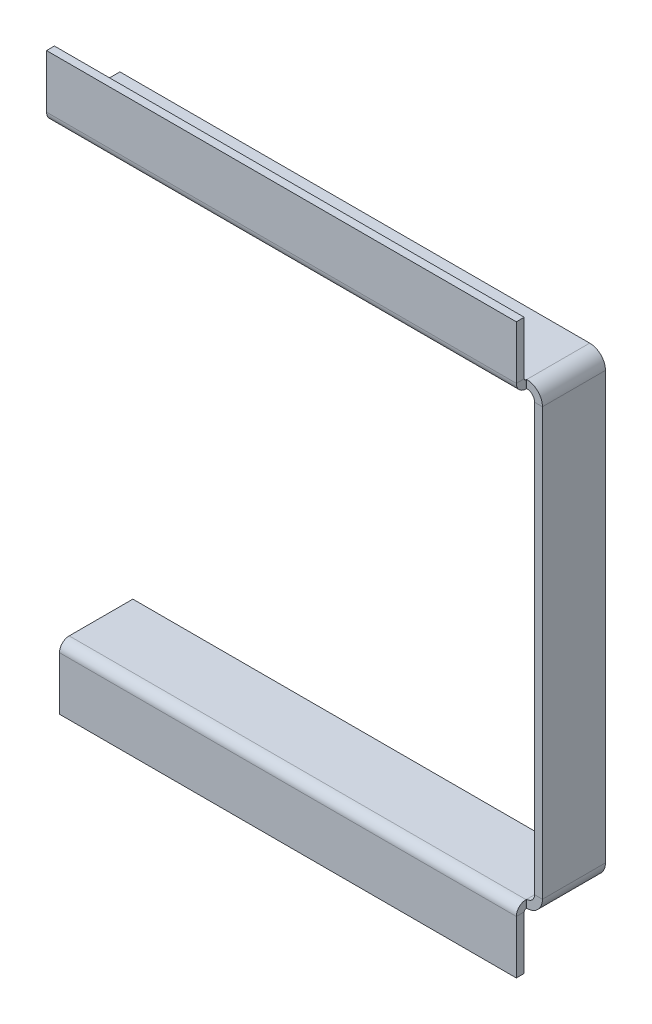
ISO-10303-21;
HEADER;
FILE_DESCRIPTION(('STEP AP214'),'2;1');
FILE_NAME('part.step','',(''),(''),'','','');
FILE_SCHEMA(('AUTOMOTIVE_DESIGN { 1 0 10303 214 1 1 1 1 }'));
ENDSEC;
DATA;
#1=APPLICATION_CONTEXT('core data for automotive mechanical design processes');
#2=APPLICATION_PROTOCOL_DEFINITION('international standard','automotive_design',2000,#1);
#3=PRODUCT_CONTEXT('',#1,'mechanical');
#4=PRODUCT('Part','Part','',(#3));
#5=PRODUCT_RELATED_PRODUCT_CATEGORY('part','',(#4));
#6=PRODUCT_DEFINITION_FORMATION('','',#4);
#7=PRODUCT_DEFINITION_CONTEXT('part definition',#1,'design');
#8=PRODUCT_DEFINITION('design','',#6,#7);
#9=PRODUCT_DEFINITION_SHAPE('','',#8);
#10=(LENGTH_UNIT() NAMED_UNIT(*) SI_UNIT(.MILLI.,.METRE.));
#11=(NAMED_UNIT(*) PLANE_ANGLE_UNIT() SI_UNIT($,.RADIAN.));
#12=(NAMED_UNIT(*) SI_UNIT($,.STERADIAN.) SOLID_ANGLE_UNIT());
#13=UNCERTAINTY_MEASURE_WITH_UNIT(LENGTH_MEASURE(1.E-05),#10,'distance_accuracy_value','');
#14=(GEOMETRIC_REPRESENTATION_CONTEXT(3) GLOBAL_UNCERTAINTY_ASSIGNED_CONTEXT((#13)) GLOBAL_UNIT_ASSIGNED_CONTEXT((#10,
#11,#12)) REPRESENTATION_CONTEXT('',''));
#15=CARTESIAN_POINT('',(0.,0.,0.));
#16=DIRECTION('',(0.,0.,1.));
#17=DIRECTION('',(1.,0.,0.));
#18=AXIS2_PLACEMENT_3D('',#15,#16,#17);
#19=CARTESIAN_POINT('',(-1.4287735626259E-12,179.254094750536,-182.429094750536));
#20=DIRECTION('',(0.,1.,0.));
#21=DIRECTION('',(0.,0.,1.));
#22=AXIS2_PLACEMENT_3D('',#19,#20,#21);
#23=PLANE('',#22);
#24=DIRECTION('',(0.,0.,1.));
#25=VECTOR('',#24,1.);
#26=CARTESIAN_POINT('',(-96.0437500000013,179.254094750536,-169.729094750535));
#27=LINE('',#26,#25);
#28=CARTESIAN_POINT('',(-96.0437500000013,179.254094750536,-169.729094750535));
#29=VERTEX_POINT('',#28);
#30=CARTESIAN_POINT('',(-96.0437500000013,179.254094750536,-169.468182493639));
#31=VERTEX_POINT('',#30);
#32=EDGE_CURVE('E52',#29,#31,#27,.T.);
#33=ORIENTED_EDGE('',*,*,#32,.T.);
#34=DIRECTION('',(-1.,0.,0.));
#35=VECTOR('',#34,1.);
#36=CARTESIAN_POINT('',(-1.33874293748464E-12,179.254094750536,-169.46818249364));
#37=LINE('',#36,#35);
#38=CARTESIAN_POINT('',(-280.183590000001,179.254094750535,-169.468182493638));
#39=VERTEX_POINT('',#38);
#40=EDGE_CURVE('E198',#31,#39,#37,.T.);
#41=ORIENTED_EDGE('',*,*,#40,.T.);
#42=DIRECTION('',(0.,0.,1.));
#43=VECTOR('',#42,1.);
#44=CARTESIAN_POINT('',(-280.183590000001,179.254094750535,-169.729094750533));
#45=LINE('',#44,#43);
#46=CARTESIAN_POINT('',(-280.183590000002,179.254094750535,-195.129094750533));
#47=VERTEX_POINT('',#46);
#48=EDGE_CURVE('E234',#47,#39,#45,.T.);
#49=ORIENTED_EDGE('',*,*,#48,.F.);
#50=DIRECTION('',(-1.,0.,0.));
#51=VECTOR('',#50,1.);
#52=CARTESIAN_POINT('',(-280.183590000002,179.254094750535,-195.129094750533));
#53=LINE('',#52,#51);
#54=CARTESIAN_POINT('',(-96.0437500000016,179.254094750536,-195.129094750535));
#55=VERTEX_POINT('',#54);
#56=EDGE_CURVE('E333',#55,#47,#53,.T.);
#57=ORIENTED_EDGE('',*,*,#56,.F.);
#58=DIRECTION('',(0.,0.,-1.));
#59=VECTOR('',#58,1.);
#60=CARTESIAN_POINT('',(-96.0437500000014,179.254094750536,-182.429094750535));
#61=LINE('',#60,#59);
#62=EDGE_CURVE('E221',#29,#55,#61,.T.);
#63=ORIENTED_EDGE('',*,*,#62,.F.);
#64=EDGE_LOOP('',(#33,#41,#49,#57,#63));
#65=FACE_BOUND('',#64,.T.);
#66=ADVANCED_FACE('F48',(#65),#23,.F.);
#67=CARTESIAN_POINT('',(-285.402672493642,363.860677244173,-169.729094750533));
#68=DIRECTION('',(-1.,0.,0.));
#69=DIRECTION('',(0.,0.,-1.));
#70=AXIS2_PLACEMENT_3D('',#67,#68,#69);
#71=PLANE('',#70);
#72=DIRECTION('',(0.,0.,-1.));
#73=VECTOR('',#72,1.);
#74=CARTESIAN_POINT('',(-285.402672493642,360.685677244173,-169.729094750533));
#75=LINE('',#74,#73);
#76=CARTESIAN_POINT('',(-285.402672493642,360.685677244173,-169.468182493637));
#77=VERTEX_POINT('',#76);
#78=CARTESIAN_POINT('',(-285.402672493642,360.685677244173,-195.129094750533));
#79=VERTEX_POINT('',#78);
#80=EDGE_CURVE('E289',#77,#79,#75,.T.);
#81=ORIENTED_EDGE('',*,*,#80,.F.);
#82=DIRECTION('',(0.,1.,0.));
#83=VECTOR('',#82,1.);
#84=CARTESIAN_POINT('',(-285.402672493642,363.860677244173,-169.468182493637));
#85=LINE('',#84,#83);
#86=CARTESIAN_POINT('',(-285.402672493642,363.860677244173,-169.468182493637));
#87=VERTEX_POINT('',#86);
#88=EDGE_CURVE('E378',#77,#87,#85,.T.);
#89=ORIENTED_EDGE('',*,*,#88,.T.);
#90=DIRECTION('',(0.,0.,-1.));
#91=VECTOR('',#90,1.);
#92=CARTESIAN_POINT('',(-285.402672493642,363.860677244173,-169.729094750533));
#93=LINE('',#92,#91);
#94=CARTESIAN_POINT('',(-285.402672493642,363.860677244173,-195.129094750533));
#95=VERTEX_POINT('',#94);
#96=EDGE_CURVE('E298',#87,#95,#93,.T.);
#97=ORIENTED_EDGE('',*,*,#96,.T.);
#98=DIRECTION('',(0.,-1.,0.));
#99=VECTOR('',#98,1.);
#100=CARTESIAN_POINT('',(-285.402672493642,363.860677244173,-195.129094750533));
#101=LINE('',#100,#99);
#102=EDGE_CURVE('E295',#95,#79,#101,.T.);
#103=ORIENTED_EDGE('',*,*,#102,.T.);
#104=EDGE_LOOP('',(#81,#89,#97,#103));
#105=FACE_BOUND('',#104,.T.);
#106=ADVANCED_FACE('F515',(#105),#71,.T.);
#107=CARTESIAN_POINT('',(-5.21908249364198,360.685677244176,-182.429094750536));
#108=DIRECTION('',(0.,-1.,0.));
#109=DIRECTION('',(0.,0.,1.));
#110=AXIS2_PLACEMENT_3D('',#107,#108,#109);
#111=PLANE('',#110);
#112=DIRECTION('',(0.,0.,-1.));
#113=VECTOR('',#112,1.);
#114=CARTESIAN_POINT('',(-96.0437500000026,360.685677244175,-169.729094750535));
#115=LINE('',#114,#113);
#116=CARTESIAN_POINT('',(-96.0437500000025,360.685677244175,-169.468182493639));
#117=VERTEX_POINT('',#116);
#118=CARTESIAN_POINT('',(-96.0437500000025,360.685677244175,-169.729094750535));
#119=VERTEX_POINT('',#118);
#120=EDGE_CURVE('E72',#117,#119,#115,.T.);
#121=ORIENTED_EDGE('',*,*,#120,.F.);
#122=DIRECTION('',(-1.,0.,0.));
#123=VECTOR('',#122,1.);
#124=CARTESIAN_POINT('',(-5.21908249364184,360.685677244176,-169.46818249364));
#125=LINE('',#124,#123);
#126=EDGE_CURVE('E380',#117,#77,#125,.T.);
#127=ORIENTED_EDGE('',*,*,#126,.T.);
#128=ORIENTED_EDGE('',*,*,#80,.T.);
#129=DIRECTION('',(1.,0.,0.));
#130=VECTOR('',#129,1.);
#131=CARTESIAN_POINT('',(274.964507506358,360.685677244179,-195.129094750539));
#132=LINE('',#131,#130);
#133=CARTESIAN_POINT('',(-96.0437500000028,360.685677244175,-195.129094750535));
#134=VERTEX_POINT('',#133);
#135=EDGE_CURVE('E286',#79,#134,#132,.T.);
#136=ORIENTED_EDGE('',*,*,#135,.T.);
#137=DIRECTION('',(0.,0.,-1.));
#138=VECTOR('',#137,1.);
#139=CARTESIAN_POINT('',(-96.0437500000027,360.685677244175,-182.429094750535));
#140=LINE('',#139,#138);
#141=EDGE_CURVE('E302',#119,#134,#140,.T.);
#142=ORIENTED_EDGE('',*,*,#141,.F.);
#143=EDGE_LOOP('',(#121,#127,#128,#136,#142));
#144=FACE_BOUND('',#143,.T.);
#145=ADVANCED_FACE('F403',(#144),#111,.T.);
#146=CARTESIAN_POINT('',(-96.0437500000026,360.685677244175,-169.729094750535));
#147=DIRECTION('',(1.,0.,0.));
#148=DIRECTION('',(0.,1.,0.));
#149=AXIS2_PLACEMENT_3D('',#146,#147,#148);
#150=PLANE('',#149);
#151=DIRECTION('',(0.,0.,-1.));
#152=VECTOR('',#151,1.);
#153=CARTESIAN_POINT('',(-96.0437500000026,363.860677244175,-169.729094750535));
#154=LINE('',#153,#152);
#155=CARTESIAN_POINT('',(-96.0437500000026,363.860677244175,-169.468182493639));
#156=VERTEX_POINT('',#155);
#157=CARTESIAN_POINT('',(-96.0437500000026,363.860677244175,-169.729094750535));
#158=VERTEX_POINT('',#157);
#159=EDGE_CURVE('E256',#156,#158,#154,.T.);
#160=ORIENTED_EDGE('',*,*,#159,.F.);
#161=DIRECTION('',(0.,-1.,0.));
#162=VECTOR('',#161,1.);
#163=CARTESIAN_POINT('',(-96.0437500000025,360.685677244175,-169.468182493639));
#164=LINE('',#163,#162);
#165=EDGE_CURVE('E208',#156,#117,#164,.T.);
#166=ORIENTED_EDGE('',*,*,#165,.T.);
#167=ORIENTED_EDGE('',*,*,#120,.T.);
#168=DIRECTION('',(0.,-1.,0.));
#169=VECTOR('',#168,1.);
#170=CARTESIAN_POINT('',(-96.0437500000026,363.860677244175,-169.729094750535));
#171=LINE('',#170,#169);
#172=EDGE_CURVE('E305',#158,#119,#171,.T.);
#173=ORIENTED_EDGE('',*,*,#172,.F.);
#174=EDGE_LOOP('',(#160,#166,#167,#173));
#175=FACE_BOUND('',#174,.T.);
#176=ADVANCED_FACE('F401',(#175),#150,.T.);
#177=CARTESIAN_POINT('',(-92.8687500000021,274.166927244175,-182.429094750535));
#178=DIRECTION('',(-1.,0.,0.));
#179=DIRECTION('',(0.,0.,1.));
#180=AXIS2_PLACEMENT_3D('',#177,#178,#179);
#181=PLANE('',#180);
#182=DIRECTION('',(0.,1.,0.));
#183=VECTOR('',#182,1.);
#184=CARTESIAN_POINT('',(-92.86875,-6.0166627558248,-169.729094750535));
#185=LINE('',#184,#183);
#186=CARTESIAN_POINT('',(-92.8687500000013,185.604094750536,-169.729094750535));
#187=VERTEX_POINT('',#186);
#188=CARTESIAN_POINT('',(-92.8687500000025,357.510677244175,-169.729094750535));
#189=VERTEX_POINT('',#188);
#190=EDGE_CURVE('E371',#187,#189,#185,.T.);
#191=ORIENTED_EDGE('',*,*,#190,.T.);
#192=DIRECTION('',(0.,0.,-1.));
#193=VECTOR('',#192,1.);
#194=CARTESIAN_POINT('',(-92.8687500000026,357.510677244175,-182.429094750535));
#195=LINE('',#194,#193);
#196=CARTESIAN_POINT('',(-92.8687500000028,357.510677244175,-195.129094750535));
#197=VERTEX_POINT('',#196);
#198=EDGE_CURVE('E359',#189,#197,#195,.T.);
#199=ORIENTED_EDGE('',*,*,#198,.T.);
#200=DIRECTION('',(0.,-1.,0.));
#201=VECTOR('',#200,1.);
#202=CARTESIAN_POINT('',(-92.8687500000002,-6.0166627558248,-195.129094750535));
#203=LINE('',#202,#201);
#204=CARTESIAN_POINT('',(-92.8687500000016,185.604094750536,-195.129094750535));
#205=VERTEX_POINT('',#204);
#206=EDGE_CURVE('E332',#197,#205,#203,.T.);
#207=ORIENTED_EDGE('',*,*,#206,.T.);
#208=DIRECTION('',(0.,0.,-1.));
#209=VECTOR('',#208,1.);
#210=CARTESIAN_POINT('',(-92.8687500000014,185.604094750536,-182.429094750535));
#211=LINE('',#210,#209);
#212=EDGE_CURVE('E349',#187,#205,#211,.T.);
#213=ORIENTED_EDGE('',*,*,#212,.F.);
#214=EDGE_LOOP('',(#191,#199,#207,#213));
#215=FACE_BOUND('',#214,.T.);
#216=ADVANCED_FACE('F419',(#215),#181,.T.);
#217=CARTESIAN_POINT('',(-89.69375,-6.01666275582485,-169.729094750535));
#218=DIRECTION('',(0.,0.,1.));
#219=DIRECTION('',(0.,1.,0.));
#220=AXIS2_PLACEMENT_3D('',#217,#218,#219);
#221=PLANE('',#220);
#222=DIRECTION('',(0.,1.,0.));
#223=VECTOR('',#222,1.);
#224=CARTESIAN_POINT('',(-89.69375,-6.01666275582485,-169.729094750535));
#225=LINE('',#224,#223);
#226=CARTESIAN_POINT('',(-89.6937500000013,185.604094750536,-169.729094750535));
#227=VERTEX_POINT('',#226);
#228=CARTESIAN_POINT('',(-89.6937500000025,357.510677244175,-169.729094750535));
#229=VERTEX_POINT('',#228);
#230=EDGE_CURVE('E347',#227,#229,#225,.T.);
#231=ORIENTED_EDGE('',*,*,#230,.T.);
#232=DIRECTION('',(-1.,0.,0.));
#233=VECTOR('',#232,1.);
#234=CARTESIAN_POINT('',(-89.6937500000025,357.510677244175,-169.729094750535));
#235=LINE('',#234,#233);
#236=EDGE_CURVE('E362',#229,#189,#235,.T.);
#237=ORIENTED_EDGE('',*,*,#236,.T.);
#238=ORIENTED_EDGE('',*,*,#190,.F.);
#239=DIRECTION('',(-1.,0.,0.));
#240=VECTOR('',#239,1.);
#241=CARTESIAN_POINT('',(-89.6937500000013,185.604094750536,-169.729094750535));
#242=LINE('',#241,#240);
#243=EDGE_CURVE('E346',#227,#187,#242,.T.);
#244=ORIENTED_EDGE('',*,*,#243,.F.);
#245=EDGE_LOOP('',(#231,#237,#238,#244));
#246=FACE_BOUND('',#245,.T.);
#247=ADVANCED_FACE('F423',(#246),#221,.T.);
#248=CARTESIAN_POINT('',(-89.6937500000002,-6.0166627558248,-195.129094750535));
#249=DIRECTION('',(0.,0.,-1.));
#250=DIRECTION('',(0.,-1.,0.));
#251=AXIS2_PLACEMENT_3D('',#248,#249,#250);
#252=PLANE('',#251);
#253=ORIENTED_EDGE('',*,*,#206,.F.);
#254=DIRECTION('',(1.,0.,0.));
#255=VECTOR('',#254,1.);
#256=CARTESIAN_POINT('',(-89.6937500000028,357.510677244175,-195.129094750535));
#257=LINE('',#256,#255);
#258=CARTESIAN_POINT('',(-89.6937500000028,357.510677244175,-195.129094750535));
#259=VERTEX_POINT('',#258);
#260=EDGE_CURVE('E356',#197,#259,#257,.T.);
#261=ORIENTED_EDGE('',*,*,#260,.T.);
#262=DIRECTION('',(0.,-1.,0.));
#263=VECTOR('',#262,1.);
#264=CARTESIAN_POINT('',(-89.6937500000002,-6.0166627558248,-195.129094750535));
#265=LINE('',#264,#263);
#266=CARTESIAN_POINT('',(-89.6937500000016,185.604094750536,-195.129094750535));
#267=VERTEX_POINT('',#266);
#268=EDGE_CURVE('E368',#259,#267,#265,.T.);
#269=ORIENTED_EDGE('',*,*,#268,.T.);
#270=DIRECTION('',(1.,0.,0.));
#271=VECTOR('',#270,1.);
#272=CARTESIAN_POINT('',(-89.6937500000016,185.604094750536,-195.129094750535));
#273=LINE('',#272,#271);
#274=EDGE_CURVE('E351',#205,#267,#273,.T.);
#275=ORIENTED_EDGE('',*,*,#274,.F.);
#276=EDGE_LOOP('',(#253,#261,#269,#275));
#277=FACE_BOUND('',#276,.T.);
#278=ADVANCED_FACE('F415',(#277),#252,.T.);
#279=CARTESIAN_POINT('',(-89.6937500000021,274.166927244175,-182.429094750535));
#280=DIRECTION('',(-1.,0.,0.));
#281=DIRECTION('',(0.,0.,1.));
#282=AXIS2_PLACEMENT_3D('',#279,#280,#281);
#283=PLANE('',#282);
#284=DIRECTION('',(0.,0.,-1.));
#285=VECTOR('',#284,1.);
#286=CARTESIAN_POINT('',(-89.6937500000027,357.510677244175,-182.429094750535));
#287=LINE('',#286,#285);
#288=EDGE_CURVE('E354',#229,#259,#287,.T.);
#289=ORIENTED_EDGE('',*,*,#288,.F.);
#290=ORIENTED_EDGE('',*,*,#230,.F.);
#291=DIRECTION('',(0.,0.,-1.));
#292=VECTOR('',#291,1.);
#293=CARTESIAN_POINT('',(-89.6937500000014,185.604094750536,-182.429094750535));
#294=LINE('',#293,#292);
#295=EDGE_CURVE('E343',#227,#267,#294,.T.);
#296=ORIENTED_EDGE('',*,*,#295,.T.);
#297=ORIENTED_EDGE('',*,*,#268,.F.);
#298=EDGE_LOOP('',(#289,#290,#296,#297));
#299=FACE_BOUND('',#298,.T.);
#300=ADVANCED_FACE('F426',(#299),#283,.F.);
#301=CARTESIAN_POINT('',(-280.183590000001,179.254094750535,-169.729094750533));
#302=DIRECTION('',(-1.,0.,0.));
#303=DIRECTION('',(0.,0.,1.));
#304=AXIS2_PLACEMENT_3D('',#301,#302,#303);
#305=PLANE('',#304);
#306=DIRECTION('',(0.,-1.,0.));
#307=VECTOR('',#306,1.);
#308=CARTESIAN_POINT('',(-280.183590000001,179.254094750535,-169.468182493638));
#309=LINE('',#308,#307);
#310=CARTESIAN_POINT('',(-280.183590000001,182.429094750535,-169.468182493638));
#311=VERTEX_POINT('',#310);
#312=EDGE_CURVE('E12',#311,#39,#309,.T.);
#313=ORIENTED_EDGE('',*,*,#312,.F.);
#314=DIRECTION('',(0.,0.,1.));
#315=VECTOR('',#314,1.);
#316=CARTESIAN_POINT('',(-280.183590000001,182.429094750535,-169.729094750533));
#317=LINE('',#316,#315);
#318=CARTESIAN_POINT('',(-280.183590000002,182.429094750535,-195.129094750533));
#319=VERTEX_POINT('',#318);
#320=EDGE_CURVE('E237',#319,#311,#317,.T.);
#321=ORIENTED_EDGE('',*,*,#320,.F.);
#322=DIRECTION('',(0.,1.,0.));
#323=VECTOR('',#322,1.);
#324=CARTESIAN_POINT('',(-280.183590000002,179.254094750535,-195.129094750533));
#325=LINE('',#324,#323);
#326=EDGE_CURVE('E329',#47,#319,#325,.T.);
#327=ORIENTED_EDGE('',*,*,#326,.F.);
#328=ORIENTED_EDGE('',*,*,#48,.T.);
#329=EDGE_LOOP('',(#313,#321,#327,#328));
#330=FACE_BOUND('',#329,.T.);
#331=ADVANCED_FACE('F50',(#330),#305,.T.);
#332=CARTESIAN_POINT('',(-1.44025926209165E-12,182.429094750536,-182.429094750536));
#333=DIRECTION('',(0.,1.,0.));
#334=DIRECTION('',(0.,0.,1.));
#335=AXIS2_PLACEMENT_3D('',#332,#333,#334);
#336=PLANE('',#335);
#337=DIRECTION('',(-1.,0.,0.));
#338=VECTOR('',#337,1.);
#339=CARTESIAN_POINT('',(-1.35022863695039E-12,182.429094750536,-169.46818249364));
#340=LINE('',#339,#338);
#341=CARTESIAN_POINT('',(-96.0437500000013,182.429094750536,-169.468182493639));
#342=VERTEX_POINT('',#341);
#343=EDGE_CURVE('E57',#342,#311,#340,.T.);
#344=ORIENTED_EDGE('',*,*,#343,.F.);
#345=DIRECTION('',(0.,0.,1.));
#346=VECTOR('',#345,1.);
#347=CARTESIAN_POINT('',(-96.0437500000013,182.429094750536,-169.729094750535));
#348=LINE('',#347,#346);
#349=CARTESIAN_POINT('',(-96.0437500000013,182.429094750536,-169.729094750535));
#350=VERTEX_POINT('',#349);
#351=EDGE_CURVE('E224',#350,#342,#348,.T.);
#352=ORIENTED_EDGE('',*,*,#351,.F.);
#353=DIRECTION('',(0.,0.,-1.));
#354=VECTOR('',#353,1.);
#355=CARTESIAN_POINT('',(-96.0437500000014,182.429094750536,-182.429094750535));
#356=LINE('',#355,#354);
#357=CARTESIAN_POINT('',(-96.0437500000016,182.429094750536,-195.129094750535));
#358=VERTEX_POINT('',#357);
#359=EDGE_CURVE('E338',#350,#358,#356,.T.);
#360=ORIENTED_EDGE('',*,*,#359,.T.);
#361=DIRECTION('',(-1.,0.,0.));
#362=VECTOR('',#361,1.);
#363=CARTESIAN_POINT('',(-280.183590000002,182.429094750535,-195.129094750533));
#364=LINE('',#363,#362);
#365=EDGE_CURVE('E240',#358,#319,#364,.T.);
#366=ORIENTED_EDGE('',*,*,#365,.T.);
#367=ORIENTED_EDGE('',*,*,#320,.T.);
#368=EDGE_LOOP('',(#344,#352,#360,#366,#367));
#369=FACE_BOUND('',#368,.T.);
#370=ADVANCED_FACE('F435',(#369),#336,.T.);
#371=CARTESIAN_POINT('',(-280.183590000002,179.254094750535,-195.129094750533));
#372=DIRECTION('',(0.,0.,-1.));
#373=DIRECTION('',(-1.,0.,0.));
#374=AXIS2_PLACEMENT_3D('',#371,#372,#373);
#375=PLANE('',#374);
#376=ORIENTED_EDGE('',*,*,#365,.F.);
#377=DIRECTION('',(0.,-1.,0.));
#378=VECTOR('',#377,1.);
#379=CARTESIAN_POINT('',(-96.0437500000016,179.254094750536,-195.129094750535));
#380=LINE('',#379,#378);
#381=EDGE_CURVE('E239',#358,#55,#380,.T.);
#382=ORIENTED_EDGE('',*,*,#381,.T.);
#383=ORIENTED_EDGE('',*,*,#56,.T.);
#384=ORIENTED_EDGE('',*,*,#326,.T.);
#385=EDGE_LOOP('',(#376,#382,#383,#384));
#386=FACE_BOUND('',#385,.T.);
#387=ADVANCED_FACE('F529',(#386),#375,.T.);
#388=CARTESIAN_POINT('',(-96.0437500000013,185.604094750536,-169.729094750535));
#389=DIRECTION('',(0.,0.,1.));
#390=DIRECTION('',(1.,0.,0.));
#391=AXIS2_PLACEMENT_3D('',#388,#389,#390);
#392=PLANE('',#391);
#393=ORIENTED_EDGE('',*,*,#243,.T.);
#394=CARTESIAN_POINT('',(-96.0437500000013,185.604094750536,-169.729094750535));
#395=DIRECTION('',(0.,0.,1.));
#396=DIRECTION('',(1.,0.,0.));
#397=AXIS2_PLACEMENT_3D('',#394,#395,#396);
#398=CIRCLE('',#397,3.175);
#399=EDGE_CURVE('E315',#187,#350,#398,.F.);
#400=ORIENTED_EDGE('',*,*,#399,.T.);
#401=DIRECTION('',(0.,1.,0.));
#402=VECTOR('',#401,1.);
#403=CARTESIAN_POINT('',(-96.0437500000013,179.254094750536,-169.729094750535));
#404=LINE('',#403,#402);
#405=EDGE_CURVE('E236',#29,#350,#404,.T.);
#406=ORIENTED_EDGE('',*,*,#405,.F.);
#407=CARTESIAN_POINT('',(-96.0437500000013,185.604094750536,-169.729094750535));
#408=DIRECTION('',(0.,0.,-1.));
#409=DIRECTION('',(1.,0.,0.));
#410=AXIS2_PLACEMENT_3D('',#407,#408,#409);
#411=CIRCLE('',#410,6.35);
#412=EDGE_CURVE('E319',#227,#29,#411,.T.);
#413=ORIENTED_EDGE('',*,*,#412,.F.);
#414=EDGE_LOOP('',(#393,#400,#406,#413));
#415=FACE_BOUND('',#414,.T.);
#416=ADVANCED_FACE('F432',(#415),#392,.T.);
#417=CARTESIAN_POINT('',(-96.0437500000016,185.604094750536,-195.129094750535));
#418=DIRECTION('',(0.,0.,-1.));
#419=DIRECTION('',(-1.,0.,0.));
#420=AXIS2_PLACEMENT_3D('',#417,#418,#419);
#421=PLANE('',#420);
#422=CARTESIAN_POINT('',(-96.0437500000016,185.604094750536,-195.129094750535));
#423=DIRECTION('',(0.,0.,1.));
#424=DIRECTION('',(1.,0.,0.));
#425=AXIS2_PLACEMENT_3D('',#422,#423,#424);
#426=CIRCLE('',#425,3.175);
#427=EDGE_CURVE('E323',#358,#205,#426,.T.);
#428=ORIENTED_EDGE('',*,*,#427,.T.);
#429=ORIENTED_EDGE('',*,*,#274,.T.);
#430=CARTESIAN_POINT('',(-96.0437500000016,185.604094750536,-195.129094750535));
#431=DIRECTION('',(0.,0.,1.));
#432=DIRECTION('',(-1.,0.,0.));
#433=AXIS2_PLACEMENT_3D('',#430,#431,#432);
#434=CIRCLE('',#433,6.35);
#435=EDGE_CURVE('E322',#55,#267,#434,.T.);
#436=ORIENTED_EDGE('',*,*,#435,.F.);
#437=ORIENTED_EDGE('',*,*,#381,.F.);
#438=EDGE_LOOP('',(#428,#429,#436,#437));
#439=FACE_BOUND('',#438,.T.);
#440=ADVANCED_FACE('F545',(#439),#421,.T.);
#441=CARTESIAN_POINT('',(-96.0437500000017,185.604094750536,-209.09751712114));
#442=DIRECTION('',(0.,0.,1.));
#443=DIRECTION('',(1.,0.,0.));
#444=AXIS2_PLACEMENT_3D('',#441,#442,#443);
#445=CYLINDRICAL_SURFACE('',#444,6.35);
#446=ORIENTED_EDGE('',*,*,#62,.T.);
#447=ORIENTED_EDGE('',*,*,#435,.T.);
#448=ORIENTED_EDGE('',*,*,#295,.F.);
#449=ORIENTED_EDGE('',*,*,#412,.T.);
#450=EDGE_LOOP('',(#446,#447,#448,#449));
#451=FACE_BOUND('',#450,.T.);
#452=ADVANCED_FACE('F429',(#451),#445,.T.);
#453=CARTESIAN_POINT('',(-96.0437500000017,185.604094750536,-209.09751712114));
#454=DIRECTION('',(0.,0.,1.));
#455=DIRECTION('',(1.,0.,0.));
#456=AXIS2_PLACEMENT_3D('',#453,#454,#455);
#457=CYLINDRICAL_SURFACE('',#456,3.175);
#458=ORIENTED_EDGE('',*,*,#359,.F.);
#459=ORIENTED_EDGE('',*,*,#399,.F.);
#460=ORIENTED_EDGE('',*,*,#212,.T.);
#461=ORIENTED_EDGE('',*,*,#427,.F.);
#462=EDGE_LOOP('',(#458,#459,#460,#461));
#463=FACE_BOUND('',#462,.T.);
#464=ADVANCED_FACE('F547',(#463),#457,.F.);
#465=CARTESIAN_POINT('',(-96.0437500000025,357.510677244175,-169.729094750535));
#466=DIRECTION('',(0.,0.,1.));
#467=DIRECTION('',(1.,0.,0.));
#468=AXIS2_PLACEMENT_3D('',#465,#466,#467);
#469=PLANE('',#468);
#470=ORIENTED_EDGE('',*,*,#172,.T.);
#471=CARTESIAN_POINT('',(-96.0437500000025,357.510677244175,-169.729094750535));
#472=DIRECTION('',(0.,0.,1.));
#473=DIRECTION('',(1.,0.,0.));
#474=AXIS2_PLACEMENT_3D('',#471,#472,#473);
#475=CIRCLE('',#474,3.175);
#476=EDGE_CURVE('E288',#119,#189,#475,.F.);
#477=ORIENTED_EDGE('',*,*,#476,.T.);
#478=ORIENTED_EDGE('',*,*,#236,.F.);
#479=CARTESIAN_POINT('',(-96.0437500000025,357.510677244175,-169.729094750535));
#480=DIRECTION('',(0.,0.,-1.));
#481=DIRECTION('',(1.,0.,0.));
#482=AXIS2_PLACEMENT_3D('',#479,#480,#481);
#483=CIRCLE('',#482,6.34999999999999);
#484=EDGE_CURVE('E308',#158,#229,#483,.T.);
#485=ORIENTED_EDGE('',*,*,#484,.F.);
#486=EDGE_LOOP('',(#470,#477,#478,#485));
#487=FACE_BOUND('',#486,.T.);
#488=ADVANCED_FACE('F399',(#487),#469,.T.);
#489=CARTESIAN_POINT('',(-96.0437500000028,357.510677244175,-195.129094750535));
#490=DIRECTION('',(0.,0.,-1.));
#491=DIRECTION('',(-1.,0.,0.));
#492=AXIS2_PLACEMENT_3D('',#489,#490,#491);
#493=PLANE('',#492);
#494=CARTESIAN_POINT('',(-96.0437500000028,357.510677244175,-195.129094750535));
#495=DIRECTION('',(0.,0.,1.));
#496=DIRECTION('',(1.,0.,0.));
#497=AXIS2_PLACEMENT_3D('',#494,#495,#496);
#498=CIRCLE('',#497,3.175);
#499=EDGE_CURVE('E312',#197,#134,#498,.T.);
#500=ORIENTED_EDGE('',*,*,#499,.T.);
#501=DIRECTION('',(0.,1.,0.));
#502=VECTOR('',#501,1.);
#503=CARTESIAN_POINT('',(-96.0437500000029,363.860677244175,-195.129094750535));
#504=LINE('',#503,#502);
#505=CARTESIAN_POINT('',(-96.0437500000029,363.860677244175,-195.129094750535));
#506=VERTEX_POINT('',#505);
#507=EDGE_CURVE('E299',#134,#506,#504,.T.);
#508=ORIENTED_EDGE('',*,*,#507,.T.);
#509=CARTESIAN_POINT('',(-96.0437500000028,357.510677244175,-195.129094750535));
#510=DIRECTION('',(0.,0.,1.));
#511=DIRECTION('',(-1.,0.,0.));
#512=AXIS2_PLACEMENT_3D('',#509,#510,#511);
#513=CIRCLE('',#512,6.34999999999999);
#514=EDGE_CURVE('E311',#259,#506,#513,.T.);
#515=ORIENTED_EDGE('',*,*,#514,.F.);
#516=ORIENTED_EDGE('',*,*,#260,.F.);
#517=EDGE_LOOP('',(#500,#508,#515,#516));
#518=FACE_BOUND('',#517,.T.);
#519=ADVANCED_FACE('F412',(#518),#493,.T.);
#520=CARTESIAN_POINT('',(-96.0437500000029,357.510677244175,-209.09751712114));
#521=DIRECTION('',(0.,0.,1.));
#522=DIRECTION('',(1.,0.,0.));
#523=AXIS2_PLACEMENT_3D('',#520,#521,#522);
#524=CYLINDRICAL_SURFACE('',#523,6.35);
#525=ORIENTED_EDGE('',*,*,#288,.T.);
#526=ORIENTED_EDGE('',*,*,#514,.T.);
#527=DIRECTION('',(0.,0.,-1.));
#528=VECTOR('',#527,1.);
#529=CARTESIAN_POINT('',(-96.0437500000027,363.860677244175,-182.429094750535));
#530=LINE('',#529,#528);
#531=EDGE_CURVE('E293',#158,#506,#530,.T.);
#532=ORIENTED_EDGE('',*,*,#531,.F.);
#533=ORIENTED_EDGE('',*,*,#484,.T.);
#534=EDGE_LOOP('',(#525,#526,#532,#533));
#535=FACE_BOUND('',#534,.T.);
#536=ADVANCED_FACE('F395',(#535),#524,.T.);
#537=CARTESIAN_POINT('',(-96.0437500000029,357.510677244175,-209.09751712114));
#538=DIRECTION('',(0.,0.,1.));
#539=DIRECTION('',(1.,0.,0.));
#540=AXIS2_PLACEMENT_3D('',#537,#538,#539);
#541=CYLINDRICAL_SURFACE('',#540,3.175);
#542=ORIENTED_EDGE('',*,*,#198,.F.);
#543=ORIENTED_EDGE('',*,*,#476,.F.);
#544=ORIENTED_EDGE('',*,*,#141,.T.);
#545=ORIENTED_EDGE('',*,*,#499,.F.);
#546=EDGE_LOOP('',(#542,#543,#544,#545));
#547=FACE_BOUND('',#546,.T.);
#548=ADVANCED_FACE('F409',(#547),#541,.F.);
#549=CARTESIAN_POINT('',(-5.219082493642,363.860677244176,-182.429094750536));
#550=DIRECTION('',(0.,-1.,0.));
#551=DIRECTION('',(0.,0.,1.));
#552=AXIS2_PLACEMENT_3D('',#549,#550,#551);
#553=PLANE('',#552);
#554=DIRECTION('',(-1.,0.,0.));
#555=VECTOR('',#554,1.);
#556=CARTESIAN_POINT('',(-5.21908249364187,363.860677244176,-169.46818249364));
#557=LINE('',#556,#555);
#558=EDGE_CURVE('E365',#156,#87,#557,.T.);
#559=ORIENTED_EDGE('',*,*,#558,.F.);
#560=ORIENTED_EDGE('',*,*,#159,.T.);
#561=ORIENTED_EDGE('',*,*,#531,.T.);
#562=DIRECTION('',(1.,0.,0.));
#563=VECTOR('',#562,1.);
#564=CARTESIAN_POINT('',(274.964507506358,363.860677244179,-195.129094750539));
#565=LINE('',#564,#563);
#566=EDGE_CURVE('E290',#95,#506,#565,.T.);
#567=ORIENTED_EDGE('',*,*,#566,.F.);
#568=ORIENTED_EDGE('',*,*,#96,.F.);
#569=EDGE_LOOP('',(#559,#560,#561,#567,#568));
#570=FACE_BOUND('',#569,.T.);
#571=ADVANCED_FACE('F388',(#570),#553,.F.);
#572=CARTESIAN_POINT('',(274.964507506358,363.860677244179,-195.129094750539));
#573=DIRECTION('',(0.,0.,-1.));
#574=DIRECTION('',(1.,0.,0.));
#575=AXIS2_PLACEMENT_3D('',#572,#573,#574);
#576=PLANE('',#575);
#577=ORIENTED_EDGE('',*,*,#507,.F.);
#578=ORIENTED_EDGE('',*,*,#135,.F.);
#579=ORIENTED_EDGE('',*,*,#102,.F.);
#580=ORIENTED_EDGE('',*,*,#566,.T.);
#581=EDGE_LOOP('',(#577,#578,#579,#580));
#582=FACE_BOUND('',#581,.T.);
#583=ADVANCED_FACE('F569',(#582),#576,.T.);
#584=CARTESIAN_POINT('',(-96.0437500000027,386.085677244175,-165.556582493639));
#585=DIRECTION('',(0.,1.,0.));
#586=DIRECTION('',(1.,0.,0.));
#587=AXIS2_PLACEMENT_3D('',#584,#585,#586);
#588=PLANE('',#587);
#589=DIRECTION('',(1.,0.,0.));
#590=VECTOR('',#589,1.);
#591=CARTESIAN_POINT('',(-96.0437500000028,386.085677244175,-168.731582493639));
#592=LINE('',#591,#590);
#593=CARTESIAN_POINT('',(-285.402672493642,386.085677244173,-168.731582493637));
#594=VERTEX_POINT('',#593);
#595=CARTESIAN_POINT('',(-96.0437500000028,386.085677244175,-168.731582493639));
#596=VERTEX_POINT('',#595);
#597=EDGE_CURVE('E264',#594,#596,#592,.T.);
#598=ORIENTED_EDGE('',*,*,#597,.F.);
#599=DIRECTION('',(0.,0.,-1.));
#600=VECTOR('',#599,1.);
#601=CARTESIAN_POINT('',(-285.402672493642,386.085677244173,-165.556582493637));
#602=LINE('',#601,#600);
#603=CARTESIAN_POINT('',(-285.402672493642,386.085677244173,-165.556582493637));
#604=VERTEX_POINT('',#603);
#605=EDGE_CURVE('E261',#604,#594,#602,.T.);
#606=ORIENTED_EDGE('',*,*,#605,.F.);
#607=DIRECTION('',(1.,0.,0.));
#608=VECTOR('',#607,1.);
#609=CARTESIAN_POINT('',(-96.0437500000027,386.085677244175,-165.556582493639));
#610=LINE('',#609,#608);
#611=CARTESIAN_POINT('',(-96.0437500000027,386.085677244175,-165.556582493639));
#612=VERTEX_POINT('',#611);
#613=EDGE_CURVE('E274',#604,#612,#610,.T.);
#614=ORIENTED_EDGE('',*,*,#613,.T.);
#615=DIRECTION('',(0.,0.,-1.));
#616=VECTOR('',#615,1.);
#617=CARTESIAN_POINT('',(-96.0437500000027,386.085677244175,-165.556582493639));
#618=LINE('',#617,#616);
#619=EDGE_CURVE('E272',#612,#596,#618,.T.);
#620=ORIENTED_EDGE('',*,*,#619,.T.);
#621=EDGE_LOOP('',(#598,#606,#614,#620));
#622=FACE_BOUND('',#621,.T.);
#623=ADVANCED_FACE('F690',(#622),#588,.T.);
#624=CARTESIAN_POINT('',(-5.21908249364166,347.985677244176,-168.73158249364));
#625=DIRECTION('',(0.,0.,1.));
#626=DIRECTION('',(0.,1.,0.));
#627=AXIS2_PLACEMENT_3D('',#624,#625,#626);
#628=PLANE('',#627);
#629=DIRECTION('',(0.,-1.,0.));
#630=VECTOR('',#629,1.);
#631=CARTESIAN_POINT('',(-96.0437500000025,360.685677244175,-168.731582493639));
#632=LINE('',#631,#630);
#633=CARTESIAN_POINT('',(-96.0437500000026,364.597277244175,-168.731582493639));
#634=VERTEX_POINT('',#633);
#635=EDGE_CURVE('E270',#596,#634,#632,.T.);
#636=ORIENTED_EDGE('',*,*,#635,.T.);
#637=DIRECTION('',(-1.,0.,0.));
#638=VECTOR('',#637,1.);
#639=CARTESIAN_POINT('',(-5.21908249364184,364.597277244176,-168.73158249364));
#640=LINE('',#639,#638);
#641=CARTESIAN_POINT('',(-285.402672493642,364.597277244173,-168.731582493637));
#642=VERTEX_POINT('',#641);
#643=EDGE_CURVE('E267',#634,#642,#640,.T.);
#644=ORIENTED_EDGE('',*,*,#643,.T.);
#645=DIRECTION('',(0.,-1.,0.));
#646=VECTOR('',#645,1.);
#647=CARTESIAN_POINT('',(-285.402672493642,360.685677244173,-168.731582493637));
#648=LINE('',#647,#646);
#649=EDGE_CURVE('E259',#594,#642,#648,.T.);
#650=ORIENTED_EDGE('',*,*,#649,.F.);
#651=ORIENTED_EDGE('',*,*,#597,.T.);
#652=EDGE_LOOP('',(#636,#644,#650,#651));
#653=FACE_BOUND('',#652,.T.);
#654=ADVANCED_FACE('F495',(#653),#628,.F.);
#655=CARTESIAN_POINT('',(-285.402672493642,360.685677244173,-168.731582493637));
#656=DIRECTION('',(-1.,0.,0.));
#657=DIRECTION('',(0.,-1.,0.));
#658=AXIS2_PLACEMENT_3D('',#655,#656,#657);
#659=PLANE('',#658);
#660=DIRECTION('',(0.,0.,-1.));
#661=VECTOR('',#660,1.);
#662=CARTESIAN_POINT('',(-285.402672493642,364.597277244173,-168.731582493637));
#663=LINE('',#662,#661);
#664=CARTESIAN_POINT('',(-285.402672493642,364.597277244173,-165.556582493637));
#665=VERTEX_POINT('',#664);
#666=EDGE_CURVE('E277',#665,#642,#663,.T.);
#667=ORIENTED_EDGE('',*,*,#666,.F.);
#668=DIRECTION('',(0.,-1.,0.));
#669=VECTOR('',#668,1.);
#670=CARTESIAN_POINT('',(-285.402672493642,360.685677244173,-165.556582493637));
#671=LINE('',#670,#669);
#672=EDGE_CURVE('E257',#604,#665,#671,.T.);
#673=ORIENTED_EDGE('',*,*,#672,.F.);
#674=ORIENTED_EDGE('',*,*,#605,.T.);
#675=ORIENTED_EDGE('',*,*,#649,.T.);
#676=EDGE_LOOP('',(#667,#673,#674,#675));
#677=FACE_BOUND('',#676,.T.);
#678=ADVANCED_FACE('F491',(#677),#659,.T.);
#679=CARTESIAN_POINT('',(-5.21908249364164,347.985677244176,-165.55658249364));
#680=DIRECTION('',(0.,0.,1.));
#681=DIRECTION('',(0.,1.,0.));
#682=AXIS2_PLACEMENT_3D('',#679,#680,#681);
#683=PLANE('',#682);
#684=DIRECTION('',(-1.,0.,0.));
#685=VECTOR('',#684,1.);
#686=CARTESIAN_POINT('',(-5.21908249364181,364.597277244176,-165.55658249364));
#687=LINE('',#686,#685);
#688=CARTESIAN_POINT('',(-96.0437500000025,364.597277244175,-165.556582493639));
#689=VERTEX_POINT('',#688);
#690=EDGE_CURVE('E280',#689,#665,#687,.T.);
#691=ORIENTED_EDGE('',*,*,#690,.F.);
#692=DIRECTION('',(0.,-1.,0.));
#693=VECTOR('',#692,1.);
#694=CARTESIAN_POINT('',(-96.0437500000025,360.685677244175,-165.556582493639));
#695=LINE('',#694,#693);
#696=EDGE_CURVE('E254',#612,#689,#695,.T.);
#697=ORIENTED_EDGE('',*,*,#696,.F.);
#698=ORIENTED_EDGE('',*,*,#613,.F.);
#699=ORIENTED_EDGE('',*,*,#672,.T.);
#700=EDGE_LOOP('',(#691,#697,#698,#699));
#701=FACE_BOUND('',#700,.T.);
#702=ADVANCED_FACE('F511',(#701),#683,.T.);
#703=CARTESIAN_POINT('',(-96.0437500000025,360.685677244175,-165.556582493639));
#704=DIRECTION('',(1.,0.,0.));
#705=DIRECTION('',(0.,0.,-1.));
#706=AXIS2_PLACEMENT_3D('',#703,#704,#705);
#707=PLANE('',#706);
#708=DIRECTION('',(0.,0.,1.));
#709=VECTOR('',#708,1.);
#710=CARTESIAN_POINT('',(-96.0437500000025,364.597277244175,-165.556582493639));
#711=LINE('',#710,#709);
#712=EDGE_CURVE('E283',#634,#689,#711,.T.);
#713=ORIENTED_EDGE('',*,*,#712,.F.);
#714=ORIENTED_EDGE('',*,*,#635,.F.);
#715=ORIENTED_EDGE('',*,*,#619,.F.);
#716=ORIENTED_EDGE('',*,*,#696,.T.);
#717=EDGE_LOOP('',(#713,#714,#715,#716));
#718=FACE_BOUND('',#717,.T.);
#719=ADVANCED_FACE('F500',(#718),#707,.T.);
#720=CARTESIAN_POINT('',(-96.0437500000026,364.597277244175,-169.468182493639));
#721=DIRECTION('',(-1.,0.,0.));
#722=DIRECTION('',(0.,1.,0.));
#723=AXIS2_PLACEMENT_3D('',#720,#721,#722);
#724=PLANE('',#723);
#725=ORIENTED_EDGE('',*,*,#712,.T.);
#726=CARTESIAN_POINT('',(-96.0437500000026,364.597277244175,-169.468182493639));
#727=DIRECTION('',(-1.,0.,0.));
#728=DIRECTION('',(0.,0.,1.));
#729=AXIS2_PLACEMENT_3D('',#726,#727,#728);
#730=CIRCLE('',#729,3.9116);
#731=EDGE_CURVE('E241',#689,#117,#730,.F.);
#732=ORIENTED_EDGE('',*,*,#731,.T.);
#733=ORIENTED_EDGE('',*,*,#165,.F.);
#734=CARTESIAN_POINT('',(-96.0437500000026,364.597277244175,-169.468182493639));
#735=DIRECTION('',(1.,0.,0.));
#736=DIRECTION('',(0.,-1.,0.));
#737=AXIS2_PLACEMENT_3D('',#734,#735,#736);
#738=CIRCLE('',#737,0.736600000000002);
#739=EDGE_CURVE('E250',#634,#156,#738,.T.);
#740=ORIENTED_EDGE('',*,*,#739,.F.);
#741=EDGE_LOOP('',(#725,#732,#733,#740));
#742=FACE_BOUND('',#741,.T.);
#743=ADVANCED_FACE('F503',(#742),#724,.F.);
#744=CARTESIAN_POINT('',(-285.402672493642,364.597277244173,-169.468182493637));
#745=DIRECTION('',(1.,0.,0.));
#746=DIRECTION('',(0.,-1.,0.));
#747=AXIS2_PLACEMENT_3D('',#744,#745,#746);
#748=PLANE('',#747);
#749=ORIENTED_EDGE('',*,*,#88,.F.);
#750=CARTESIAN_POINT('',(-285.402672493642,364.597277244173,-169.468182493637));
#751=DIRECTION('',(-1.,0.,0.));
#752=DIRECTION('',(0.,0.,1.));
#753=AXIS2_PLACEMENT_3D('',#750,#751,#752);
#754=CIRCLE('',#753,3.9116);
#755=EDGE_CURVE('E243',#77,#665,#754,.T.);
#756=ORIENTED_EDGE('',*,*,#755,.T.);
#757=ORIENTED_EDGE('',*,*,#666,.T.);
#758=CARTESIAN_POINT('',(-285.402672493642,364.597277244173,-169.468182493637));
#759=DIRECTION('',(-1.,0.,0.));
#760=DIRECTION('',(0.,-1.,0.));
#761=AXIS2_PLACEMENT_3D('',#758,#759,#760);
#762=CIRCLE('',#761,0.736599999999988);
#763=EDGE_CURVE('E285',#87,#642,#762,.T.);
#764=ORIENTED_EDGE('',*,*,#763,.F.);
#765=EDGE_LOOP('',(#749,#756,#757,#764));
#766=FACE_BOUND('',#765,.T.);
#767=ADVANCED_FACE('F487',(#766),#748,.F.);
#768=CARTESIAN_POINT('',(-1.30248990422535,364.597277244176,-169.46818249364));
#769=DIRECTION('',(-1.,0.,0.));
#770=DIRECTION('',(0.,0.,1.));
#771=AXIS2_PLACEMENT_3D('',#768,#769,#770);
#772=CYLINDRICAL_SURFACE('',#771,0.7366);
#773=ORIENTED_EDGE('',*,*,#763,.T.);
#774=ORIENTED_EDGE('',*,*,#643,.F.);
#775=ORIENTED_EDGE('',*,*,#739,.T.);
#776=ORIENTED_EDGE('',*,*,#558,.T.);
#777=EDGE_LOOP('',(#773,#774,#775,#776));
#778=FACE_BOUND('',#777,.T.);
#779=ADVANCED_FACE('F484',(#778),#772,.F.);
#780=CARTESIAN_POINT('',(-1.30248990422535,364.597277244176,-169.46818249364));
#781=DIRECTION('',(-1.,0.,0.));
#782=DIRECTION('',(0.,0.,1.));
#783=AXIS2_PLACEMENT_3D('',#780,#781,#782);
#784=CYLINDRICAL_SURFACE('',#783,3.9116);
#785=ORIENTED_EDGE('',*,*,#755,.F.);
#786=ORIENTED_EDGE('',*,*,#126,.F.);
#787=ORIENTED_EDGE('',*,*,#731,.F.);
#788=ORIENTED_EDGE('',*,*,#690,.T.);
#789=EDGE_LOOP('',(#785,#786,#787,#788));
#790=FACE_BOUND('',#789,.T.);
#791=ADVANCED_FACE('F527',(#790),#784,.T.);
#792=CARTESIAN_POINT('',(-96.0437500000013,182.429094750536,-169.729094750535));
#793=DIRECTION('',(1.,0.,0.));
#794=DIRECTION('',(0.,-1.,0.));
#795=AXIS2_PLACEMENT_3D('',#792,#793,#794);
#796=PLANE('',#795);
#797=DIRECTION('',(0.,1.,0.));
#798=VECTOR('',#797,1.);
#799=CARTESIAN_POINT('',(-96.0437500000013,182.429094750536,-169.468182493639));
#800=LINE('',#799,#798);
#801=EDGE_CURVE('E207',#31,#342,#800,.T.);
#802=ORIENTED_EDGE('',*,*,#801,.F.);
#803=ORIENTED_EDGE('',*,*,#32,.F.);
#804=ORIENTED_EDGE('',*,*,#405,.T.);
#805=ORIENTED_EDGE('',*,*,#351,.T.);
#806=EDGE_LOOP('',(#802,#803,#804,#805));
#807=FACE_BOUND('',#806,.T.);
#808=ADVANCED_FACE('F227',(#807),#796,.T.);
#809=CARTESIAN_POINT('',(-96.0437500000013,157.029094750536,-165.556582493639));
#810=DIRECTION('',(0.,-1.,0.));
#811=DIRECTION('',(0.,0.,-1.));
#812=AXIS2_PLACEMENT_3D('',#809,#810,#811);
#813=PLANE('',#812);
#814=DIRECTION('',(-1.,0.,0.));
#815=VECTOR('',#814,1.);
#816=CARTESIAN_POINT('',(-96.0437500000013,157.029094750536,-168.731582493639));
#817=LINE('',#816,#815);
#818=CARTESIAN_POINT('',(-96.0437500000013,157.029094750536,-168.731582493639));
#819=VERTEX_POINT('',#818);
#820=CARTESIAN_POINT('',(-280.183590000001,157.029094750536,-168.731582493638));
#821=VERTEX_POINT('',#820);
#822=EDGE_CURVE('E466',#819,#821,#817,.T.);
#823=ORIENTED_EDGE('',*,*,#822,.F.);
#824=DIRECTION('',(0.,0.,-1.));
#825=VECTOR('',#824,1.);
#826=CARTESIAN_POINT('',(-96.0437500000013,157.029094750536,-165.556582493639));
#827=LINE('',#826,#825);
#828=CARTESIAN_POINT('',(-96.0437500000013,157.029094750536,-165.556582493639));
#829=VERTEX_POINT('',#828);
#830=EDGE_CURVE('E460',#829,#819,#827,.T.);
#831=ORIENTED_EDGE('',*,*,#830,.F.);
#832=DIRECTION('',(-1.,0.,0.));
#833=VECTOR('',#832,1.);
#834=CARTESIAN_POINT('',(-96.0437500000013,157.029094750536,-165.556582493639));
#835=LINE('',#834,#833);
#836=CARTESIAN_POINT('',(-280.183590000001,157.029094750536,-165.556582493638));
#837=VERTEX_POINT('',#836);
#838=EDGE_CURVE('E474',#829,#837,#835,.T.);
#839=ORIENTED_EDGE('',*,*,#838,.T.);
#840=DIRECTION('',(0.,0.,-1.));
#841=VECTOR('',#840,1.);
#842=CARTESIAN_POINT('',(-280.183590000001,157.029094750536,-165.556582493638));
#843=LINE('',#842,#841);
#844=EDGE_CURVE('E471',#837,#821,#843,.T.);
#845=ORIENTED_EDGE('',*,*,#844,.T.);
#846=EDGE_LOOP('',(#823,#831,#839,#845));
#847=FACE_BOUND('',#846,.T.);
#848=ADVANCED_FACE('F526',(#847),#813,.T.);
#849=CARTESIAN_POINT('',(-1.40983334215473E-12,195.129094750536,-168.73158249364));
#850=DIRECTION('',(0.,0.,1.));
#851=DIRECTION('',(0.,-1.,0.));
#852=AXIS2_PLACEMENT_3D('',#849,#850,#851);
#853=PLANE('',#852);
#854=DIRECTION('',(-1.,0.,0.));
#855=VECTOR('',#854,1.);
#856=CARTESIAN_POINT('',(-1.34974016254994E-12,178.517494750536,-168.73158249364));
#857=LINE('',#856,#855);
#858=CARTESIAN_POINT('',(-96.0437500000013,178.517494750536,-168.731582493639));
#859=VERTEX_POINT('',#858);
#860=CARTESIAN_POINT('',(-280.183590000001,178.517494750535,-168.731582493638));
#861=VERTEX_POINT('',#860);
#862=EDGE_CURVE('E477',#859,#861,#857,.T.);
#863=ORIENTED_EDGE('',*,*,#862,.F.);
#864=DIRECTION('',(0.,-1.,0.));
#865=VECTOR('',#864,1.);
#866=CARTESIAN_POINT('',(-96.0437500000013,182.429094750536,-168.731582493639));
#867=LINE('',#866,#865);
#868=EDGE_CURVE('E469',#859,#819,#867,.T.);
#869=ORIENTED_EDGE('',*,*,#868,.T.);
#870=ORIENTED_EDGE('',*,*,#822,.T.);
#871=DIRECTION('',(0.,-1.,0.));
#872=VECTOR('',#871,1.);
#873=CARTESIAN_POINT('',(-280.183590000001,182.429094750535,-168.731582493638));
#874=LINE('',#873,#872);
#875=EDGE_CURVE('E225',#861,#821,#874,.T.);
#876=ORIENTED_EDGE('',*,*,#875,.F.);
#877=EDGE_LOOP('',(#863,#869,#870,#876));
#878=FACE_BOUND('',#877,.T.);
#879=ADVANCED_FACE('F782',(#878),#853,.F.);
#880=CARTESIAN_POINT('',(-96.0437500000013,182.429094750536,-165.556582493639));
#881=DIRECTION('',(1.,0.,0.));
#882=DIRECTION('',(0.,0.,-1.));
#883=AXIS2_PLACEMENT_3D('',#880,#881,#882);
#884=PLANE('',#883);
#885=ORIENTED_EDGE('',*,*,#868,.F.);
#886=DIRECTION('',(0.,0.,1.));
#887=VECTOR('',#886,1.);
#888=CARTESIAN_POINT('',(-96.0437500000013,178.517494750536,-165.556582493639));
#889=LINE('',#888,#887);
#890=CARTESIAN_POINT('',(-96.0437500000013,178.517494750536,-165.556582493639));
#891=VERTEX_POINT('',#890);
#892=EDGE_CURVE('E215',#859,#891,#889,.T.);
#893=ORIENTED_EDGE('',*,*,#892,.T.);
#894=DIRECTION('',(0.,-1.,0.));
#895=VECTOR('',#894,1.);
#896=CARTESIAN_POINT('',(-96.0437500000013,182.429094750536,-165.556582493639));
#897=LINE('',#896,#895);
#898=EDGE_CURVE('E463',#891,#829,#897,.T.);
#899=ORIENTED_EDGE('',*,*,#898,.T.);
#900=ORIENTED_EDGE('',*,*,#830,.T.);
#901=EDGE_LOOP('',(#885,#893,#899,#900));
#902=FACE_BOUND('',#901,.T.);
#903=ADVANCED_FACE('F793',(#902),#884,.T.);
#904=CARTESIAN_POINT('',(-1.38777878078145E-12,195.129094750536,-165.55658249364));
#905=DIRECTION('',(0.,0.,1.));
#906=DIRECTION('',(0.,-1.,0.));
#907=AXIS2_PLACEMENT_3D('',#904,#905,#906);
#908=PLANE('',#907);
#909=ORIENTED_EDGE('',*,*,#898,.F.);
#910=DIRECTION('',(-1.,0.,0.));
#911=VECTOR('',#910,1.);
#912=CARTESIAN_POINT('',(-1.32768560117665E-12,178.517494750536,-165.55658249364));
#913=LINE('',#912,#911);
#914=CARTESIAN_POINT('',(-280.183590000001,178.517494750536,-165.556582493638));
#915=VERTEX_POINT('',#914);
#916=EDGE_CURVE('E457',#891,#915,#913,.T.);
#917=ORIENTED_EDGE('',*,*,#916,.T.);
#918=DIRECTION('',(0.,-1.,0.));
#919=VECTOR('',#918,1.);
#920=CARTESIAN_POINT('',(-280.183590000001,182.429094750535,-165.556582493638));
#921=LINE('',#920,#919);
#922=EDGE_CURVE('E455',#915,#837,#921,.T.);
#923=ORIENTED_EDGE('',*,*,#922,.T.);
#924=ORIENTED_EDGE('',*,*,#838,.F.);
#925=EDGE_LOOP('',(#909,#917,#923,#924));
#926=FACE_BOUND('',#925,.T.);
#927=ADVANCED_FACE('F804',(#926),#908,.T.);
#928=CARTESIAN_POINT('',(-280.183590000001,182.429094750535,-168.731582493638));
#929=DIRECTION('',(-1.,0.,0.));
#930=DIRECTION('',(0.,-1.,0.));
#931=AXIS2_PLACEMENT_3D('',#928,#929,#930);
#932=PLANE('',#931);
#933=ORIENTED_EDGE('',*,*,#922,.F.);
#934=DIRECTION('',(0.,0.,-1.));
#935=VECTOR('',#934,1.);
#936=CARTESIAN_POINT('',(-280.183590000001,178.517494750535,-168.731582493638));
#937=LINE('',#936,#935);
#938=EDGE_CURVE('E448',#915,#861,#937,.T.);
#939=ORIENTED_EDGE('',*,*,#938,.T.);
#940=ORIENTED_EDGE('',*,*,#875,.T.);
#941=ORIENTED_EDGE('',*,*,#844,.F.);
#942=EDGE_LOOP('',(#933,#939,#940,#941));
#943=FACE_BOUND('',#942,.T.);
#944=ADVANCED_FACE('F815',(#943),#932,.T.);
#945=CARTESIAN_POINT('',(-96.0437500000013,178.517494750536,-169.468182493639));
#946=DIRECTION('',(-1.,0.,0.));
#947=DIRECTION('',(0.,0.,1.));
#948=AXIS2_PLACEMENT_3D('',#945,#946,#947);
#949=PLANE('',#948);
#950=ORIENTED_EDGE('',*,*,#801,.T.);
#951=CARTESIAN_POINT('',(-96.0437500000013,178.517494750536,-169.468182493639));
#952=DIRECTION('',(1.,0.,0.));
#953=DIRECTION('',(0.,0.,-1.));
#954=AXIS2_PLACEMENT_3D('',#951,#952,#953);
#955=CIRCLE('',#954,3.9116);
#956=EDGE_CURVE('E444',#342,#891,#955,.T.);
#957=ORIENTED_EDGE('',*,*,#956,.T.);
#958=ORIENTED_EDGE('',*,*,#892,.F.);
#959=CARTESIAN_POINT('',(-96.0437500000013,178.517494750536,-169.468182493639));
#960=DIRECTION('',(1.,0.,0.));
#961=DIRECTION('',(0.,0.,-1.));
#962=AXIS2_PLACEMENT_3D('',#959,#960,#961);
#963=CIRCLE('',#962,0.736600000000004);
#964=EDGE_CURVE('E201',#31,#859,#963,.T.);
#965=ORIENTED_EDGE('',*,*,#964,.F.);
#966=EDGE_LOOP('',(#950,#957,#958,#965));
#967=FACE_BOUND('',#966,.T.);
#968=ADVANCED_FACE('F211',(#967),#949,.F.);
#969=CARTESIAN_POINT('',(-280.183590000001,178.517494750535,-169.468182493638));
#970=DIRECTION('',(1.,0.,0.));
#971=DIRECTION('',(0.,0.,-1.));
#972=AXIS2_PLACEMENT_3D('',#969,#970,#971);
#973=PLANE('',#972);
#974=CARTESIAN_POINT('',(-280.183590000001,178.517494750535,-169.468182493638));
#975=DIRECTION('',(1.,0.,0.));
#976=DIRECTION('',(0.,0.,-1.));
#977=AXIS2_PLACEMENT_3D('',#974,#975,#976);
#978=CIRCLE('',#977,3.9116);
#979=EDGE_CURVE('E216',#915,#311,#978,.F.);
#980=ORIENTED_EDGE('',*,*,#979,.T.);
#981=ORIENTED_EDGE('',*,*,#312,.T.);
#982=CARTESIAN_POINT('',(-280.183590000001,178.517494750535,-169.468182493638));
#983=DIRECTION('',(-1.,0.,0.));
#984=DIRECTION('',(0.,0.,-1.));
#985=AXIS2_PLACEMENT_3D('',#982,#983,#984);
#986=CIRCLE('',#985,0.736600000000004);
#987=EDGE_CURVE('E65',#861,#39,#986,.T.);
#988=ORIENTED_EDGE('',*,*,#987,.F.);
#989=ORIENTED_EDGE('',*,*,#938,.F.);
#990=EDGE_LOOP('',(#980,#981,#988,#989));
#991=FACE_BOUND('',#990,.T.);
#992=ADVANCED_FACE('F446',(#991),#973,.F.);
#993=CARTESIAN_POINT('',(-372.317059820122,178.517494750535,-169.468182493637));
#994=DIRECTION('',(1.,0.,0.));
#995=DIRECTION('',(0.,0.,-1.));
#996=AXIS2_PLACEMENT_3D('',#993,#994,#995);
#997=CYLINDRICAL_SURFACE('',#996,0.7366);
#998=ORIENTED_EDGE('',*,*,#862,.T.);
#999=ORIENTED_EDGE('',*,*,#987,.T.);
#1000=ORIENTED_EDGE('',*,*,#40,.F.);
#1001=ORIENTED_EDGE('',*,*,#964,.T.);
#1002=EDGE_LOOP('',(#998,#999,#1000,#1001));
#1003=FACE_BOUND('',#1002,.T.);
#1004=ADVANCED_FACE('F200',(#1003),#997,.F.);
#1005=CARTESIAN_POINT('',(-372.317059820122,178.517494750535,-169.468182493637));
#1006=DIRECTION('',(1.,0.,0.));
#1007=DIRECTION('',(0.,0.,-1.));
#1008=AXIS2_PLACEMENT_3D('',#1005,#1006,#1007);
#1009=CYLINDRICAL_SURFACE('',#1008,3.9116);
#1010=ORIENTED_EDGE('',*,*,#916,.F.);
#1011=ORIENTED_EDGE('',*,*,#956,.F.);
#1012=ORIENTED_EDGE('',*,*,#343,.T.);
#1013=ORIENTED_EDGE('',*,*,#979,.F.);
#1014=EDGE_LOOP('',(#1010,#1011,#1012,#1013));
#1015=FACE_BOUND('',#1014,.T.);
#1016=ADVANCED_FACE('F442',(#1015),#1009,.T.);
#1017=CLOSED_SHELL('',(#66,#106,#145,#176,#216,#247,#278,#300,#331,#370,#387,#416,#440,#452,
#464,#488,#519,#536,#548,#571,#583,#623,#654,#678,#702,#719,#743,#767,#779,#791,#808,#848,#879,
#903,#927,#944,#968,#992,#1004,#1016));
#1018=MANIFOLD_SOLID_BREP('B2',#1017);
#1019=ADVANCED_BREP_SHAPE_REPRESENTATION('',(#18,#1018),#14);
#1020=SHAPE_DEFINITION_REPRESENTATION(#9,#1019);
ENDSEC;
END-ISO-10303-21;
